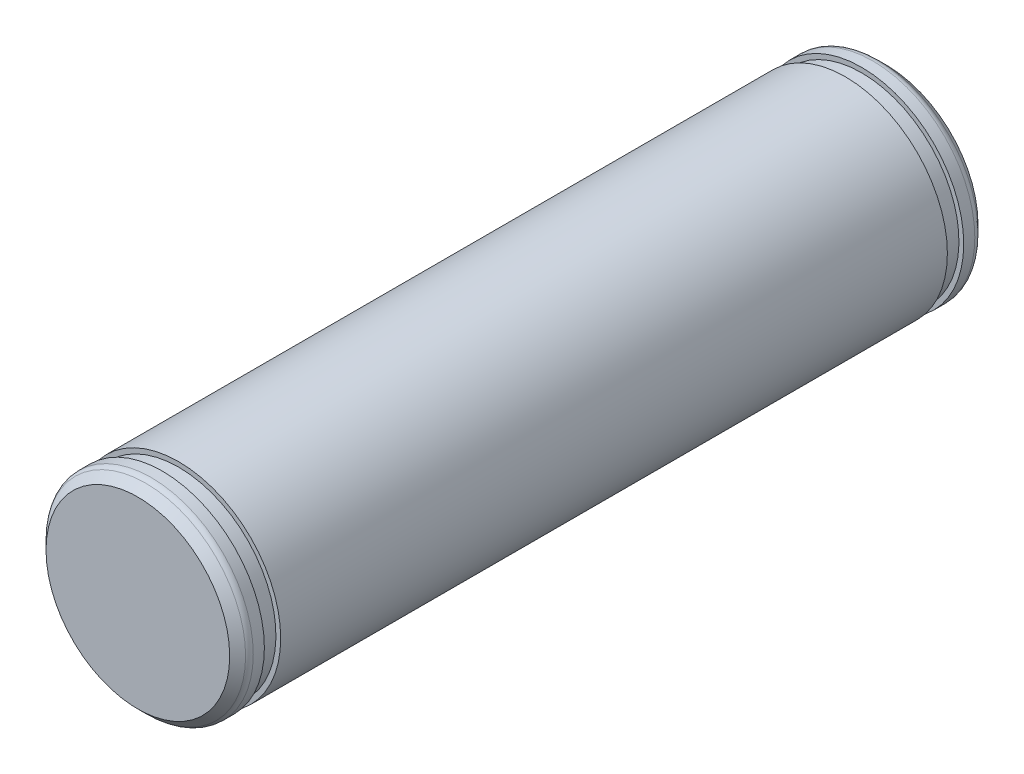
ISO-10303-21;
HEADER;
FILE_DESCRIPTION(('STEP AP214'),'2;1');
FILE_NAME('part.step','',(''),(''),'','','');
FILE_SCHEMA(('AUTOMOTIVE_DESIGN { 1 0 10303 214 1 1 1 1 }'));
ENDSEC;
DATA;
#1=APPLICATION_CONTEXT('core data for automotive mechanical design processes');
#2=APPLICATION_PROTOCOL_DEFINITION('international standard','automotive_design',2000,#1);
#3=PRODUCT_CONTEXT('',#1,'mechanical');
#4=PRODUCT('Part','Part','',(#3));
#5=PRODUCT_RELATED_PRODUCT_CATEGORY('part','',(#4));
#6=PRODUCT_DEFINITION_FORMATION('','',#4);
#7=PRODUCT_DEFINITION_CONTEXT('part definition',#1,'design');
#8=PRODUCT_DEFINITION('design','',#6,#7);
#9=PRODUCT_DEFINITION_SHAPE('','',#8);
#10=(LENGTH_UNIT() NAMED_UNIT(*) SI_UNIT(.MILLI.,.METRE.));
#11=(NAMED_UNIT(*) PLANE_ANGLE_UNIT() SI_UNIT($,.RADIAN.));
#12=(NAMED_UNIT(*) SI_UNIT($,.STERADIAN.) SOLID_ANGLE_UNIT());
#13=UNCERTAINTY_MEASURE_WITH_UNIT(LENGTH_MEASURE(1.E-05),#10,'distance_accuracy_value','');
#14=(GEOMETRIC_REPRESENTATION_CONTEXT(3) GLOBAL_UNCERTAINTY_ASSIGNED_CONTEXT((#13)) GLOBAL_UNIT_ASSIGNED_CONTEXT((#10,
#11,#12)) REPRESENTATION_CONTEXT('',''));
#15=CARTESIAN_POINT('',(0.,0.,0.));
#16=DIRECTION('',(0.,0.,1.));
#17=DIRECTION('',(1.,0.,0.));
#18=AXIS2_PLACEMENT_3D('',#15,#16,#17);
#19=CARTESIAN_POINT('',(0.,0.,27.5));
#20=DIRECTION('',(0.,0.,-1.));
#21=DIRECTION('',(-1.,0.,0.));
#22=AXIS2_PLACEMENT_3D('',#19,#20,#21);
#23=CYLINDRICAL_SURFACE('',#22,7.5);
#24=CARTESIAN_POINT('',(0.,0.,24.5));
#25=DIRECTION('',(0.,0.,-1.));
#26=DIRECTION('',(0.,1.,0.));
#27=AXIS2_PLACEMENT_3D('',#24,#25,#26);
#28=CIRCLE('',#27,7.49999999999999);
#29=CARTESIAN_POINT('',(0.,7.5,24.5));
#30=VERTEX_POINT('',#29);
#31=EDGE_CURVE('E107',#30,#30,#28,.T.);
#32=ORIENTED_EDGE('',*,*,#31,.T.);
#33=EDGE_LOOP('',(#32));
#34=FACE_BOUND('',#33,.T.);
#35=CARTESIAN_POINT('',(0.,0.,-24.5));
#36=DIRECTION('',(0.,0.,-1.));
#37=DIRECTION('',(0.,1.,0.));
#38=AXIS2_PLACEMENT_3D('',#35,#36,#37);
#39=CIRCLE('',#38,7.49999999999999);
#40=CARTESIAN_POINT('',(0.,7.5,-24.5));
#41=VERTEX_POINT('',#40);
#42=EDGE_CURVE('E91',#41,#41,#39,.T.);
#43=ORIENTED_EDGE('',*,*,#42,.F.);
#44=EDGE_LOOP('',(#43));
#45=FACE_BOUND('',#44,.T.);
#46=ADVANCED_FACE('F53',(#34,#45),#23,.T.);
#47=CARTESIAN_POINT('',(0.,0.,-27.5));
#48=DIRECTION('',(0.,0.,-1.));
#49=DIRECTION('',(0.,1.,0.));
#50=AXIS2_PLACEMENT_3D('',#47,#48,#49);
#51=CYLINDRICAL_SURFACE('',#50,7.14999999999999);
#52=CARTESIAN_POINT('',(0.,0.,-25.7));
#53=DIRECTION('',(0.,0.,-1.));
#54=DIRECTION('',(0.,1.,0.));
#55=AXIS2_PLACEMENT_3D('',#52,#53,#54);
#56=CIRCLE('',#55,7.14999999999999);
#57=CARTESIAN_POINT('',(0.,7.15,-25.7));
#58=VERTEX_POINT('',#57);
#59=EDGE_CURVE('E99',#58,#58,#56,.T.);
#60=ORIENTED_EDGE('',*,*,#59,.F.);
#61=EDGE_LOOP('',(#60));
#62=FACE_BOUND('',#61,.T.);
#63=CARTESIAN_POINT('',(0.,0.,-24.5));
#64=DIRECTION('',(0.,0.,-1.));
#65=DIRECTION('',(0.,1.,0.));
#66=AXIS2_PLACEMENT_3D('',#63,#64,#65);
#67=CIRCLE('',#66,7.14999999999999);
#68=CARTESIAN_POINT('',(0.,7.15,-24.5));
#69=VERTEX_POINT('',#68);
#70=EDGE_CURVE('E87',#69,#69,#67,.T.);
#71=ORIENTED_EDGE('',*,*,#70,.T.);
#72=EDGE_LOOP('',(#71));
#73=FACE_BOUND('',#72,.T.);
#74=ADVANCED_FACE('F141',(#62,#73),#51,.T.);
#75=CARTESIAN_POINT('',(0.,7.15,-24.5));
#76=DIRECTION('',(0.,0.,1.));
#77=DIRECTION('',(0.,-1.,0.));
#78=AXIS2_PLACEMENT_3D('',#75,#76,#77);
#79=PLANE('',#78);
#80=ORIENTED_EDGE('',*,*,#70,.F.);
#81=EDGE_LOOP('',(#80));
#82=FACE_BOUND('',#81,.T.);
#83=ORIENTED_EDGE('',*,*,#42,.T.);
#84=EDGE_LOOP('',(#83));
#85=FACE_BOUND('',#84,.T.);
#86=ADVANCED_FACE('F151',(#82,#85),#79,.F.);
#87=CARTESIAN_POINT('',(0.,7.5,-25.7));
#88=DIRECTION('',(0.,0.,-1.));
#89=DIRECTION('',(0.,1.,0.));
#90=AXIS2_PLACEMENT_3D('',#87,#88,#89);
#91=PLANE('',#90);
#92=CARTESIAN_POINT('',(0.,0.,-25.7));
#93=DIRECTION('',(0.,0.,-1.));
#94=DIRECTION('',(0.,1.,0.));
#95=AXIS2_PLACEMENT_3D('',#92,#93,#94);
#96=CIRCLE('',#95,7.49999999999999);
#97=CARTESIAN_POINT('',(0.,7.5,-25.7));
#98=VERTEX_POINT('',#97);
#99=EDGE_CURVE('E95',#98,#98,#96,.T.);
#100=ORIENTED_EDGE('',*,*,#99,.F.);
#101=EDGE_LOOP('',(#100));
#102=FACE_BOUND('',#101,.T.);
#103=ORIENTED_EDGE('',*,*,#59,.T.);
#104=EDGE_LOOP('',(#103));
#105=FACE_BOUND('',#104,.T.);
#106=ADVANCED_FACE('F172',(#102,#105),#91,.F.);
#107=CARTESIAN_POINT('',(0.,0.,-27.5));
#108=DIRECTION('',(0.,0.,1.));
#109=DIRECTION('',(1.,0.,0.));
#110=AXIS2_PLACEMENT_3D('',#107,#108,#109);
#111=PLANE('',#110);
#112=CARTESIAN_POINT('',(0.,0.,-27.5));
#113=DIRECTION('',(0.,0.,1.));
#114=DIRECTION('',(1.,0.,0.));
#115=AXIS2_PLACEMENT_3D('',#112,#113,#114);
#116=CIRCLE('',#115,6.74999999999999);
#117=CARTESIAN_POINT('',(6.74999999999999,0.,-27.5));
#118=VERTEX_POINT('',#117);
#119=EDGE_CURVE('E79',#118,#118,#116,.F.);
#120=ORIENTED_EDGE('',*,*,#119,.T.);
#121=EDGE_LOOP('',(#120));
#122=FACE_BOUND('',#121,.T.);
#123=ADVANCED_FACE('F174',(#122),#111,.F.);
#124=CARTESIAN_POINT('',(0.,0.,-26.75));
#125=DIRECTION('',(0.,0.,1.));
#126=DIRECTION('',(1.,0.,0.));
#127=AXIS2_PLACEMENT_3D('',#124,#125,#126);
#128=CONICAL_SURFACE('',#127,7.5,0.785398163397453);
#129=CARTESIAN_POINT('',(0.,0.,-26.9147524355826));
#130=DIRECTION('',(0.,0.,1.));
#131=DIRECTION('',(1.,0.,0.));
#132=AXIS2_PLACEMENT_3D('',#129,#130,#131);
#133=CIRCLE('',#132,7.33524756441743);
#134=CARTESIAN_POINT('',(7.33524756441743,0.,-26.9147524355826));
#135=VERTEX_POINT('',#134);
#136=EDGE_CURVE('E12',#135,#135,#133,.F.);
#137=ORIENTED_EDGE('',*,*,#136,.T.);
#138=EDGE_LOOP('',(#137));
#139=FACE_BOUND('',#138,.T.);
#140=ORIENTED_EDGE('',*,*,#119,.F.);
#141=EDGE_LOOP('',(#140));
#142=FACE_BOUND('',#141,.T.);
#143=ADVANCED_FACE('F165',(#139,#142),#128,.T.);
#144=CARTESIAN_POINT('',(0.,0.,-26.5170048711651));
#145=DIRECTION('',(0.,0.,-1.));
#146=DIRECTION('',(-1.,0.,0.));
#147=AXIS2_PLACEMENT_3D('',#144,#145,#146);
#148=TOROIDAL_SURFACE('',#147,6.9375,0.5625);
#149=ORIENTED_EDGE('',*,*,#136,.F.);
#150=EDGE_LOOP('',(#149));
#151=FACE_BOUND('',#150,.T.);
#152=CARTESIAN_POINT('',(0.,0.,-26.5170048711651));
#153=DIRECTION('',(0.,0.,-1.));
#154=DIRECTION('',(-1.,0.,0.));
#155=AXIS2_PLACEMENT_3D('',#152,#153,#154);
#156=CIRCLE('',#155,7.5);
#157=CARTESIAN_POINT('',(-7.5,0.,-26.5170048711651));
#158=VERTEX_POINT('',#157);
#159=EDGE_CURVE('E73',#158,#158,#156,.F.);
#160=ORIENTED_EDGE('',*,*,#159,.F.);
#161=EDGE_LOOP('',(#160));
#162=FACE_BOUND('',#161,.T.);
#163=ADVANCED_FACE('F55',(#151,#162),#148,.T.);
#164=ORIENTED_EDGE('',*,*,#99,.T.);
#165=EDGE_LOOP('',(#164));
#166=FACE_BOUND('',#165,.T.);
#167=ORIENTED_EDGE('',*,*,#159,.T.);
#168=EDGE_LOOP('',(#167));
#169=FACE_BOUND('',#168,.T.);
#170=ADVANCED_FACE('F145',(#166,#169),#23,.T.);
#171=CARTESIAN_POINT('',(0.,0.,27.5));
#172=DIRECTION('',(0.,0.,1.));
#173=DIRECTION('',(0.,1.,0.));
#174=AXIS2_PLACEMENT_3D('',#171,#172,#173);
#175=CYLINDRICAL_SURFACE('',#174,7.14999999999999);
#176=CARTESIAN_POINT('',(0.,0.,25.7));
#177=DIRECTION('',(0.,0.,-1.));
#178=DIRECTION('',(0.,1.,0.));
#179=AXIS2_PLACEMENT_3D('',#176,#177,#178);
#180=CIRCLE('',#179,7.14999999999999);
#181=CARTESIAN_POINT('',(0.,7.15,25.7));
#182=VERTEX_POINT('',#181);
#183=EDGE_CURVE('E115',#182,#182,#180,.T.);
#184=ORIENTED_EDGE('',*,*,#183,.T.);
#185=EDGE_LOOP('',(#184));
#186=FACE_BOUND('',#185,.T.);
#187=CARTESIAN_POINT('',(0.,0.,24.5));
#188=DIRECTION('',(0.,0.,-1.));
#189=DIRECTION('',(0.,1.,0.));
#190=AXIS2_PLACEMENT_3D('',#187,#188,#189);
#191=CIRCLE('',#190,7.14999999999999);
#192=CARTESIAN_POINT('',(0.,7.15,24.5));
#193=VERTEX_POINT('',#192);
#194=EDGE_CURVE('E103',#193,#193,#191,.T.);
#195=ORIENTED_EDGE('',*,*,#194,.F.);
#196=EDGE_LOOP('',(#195));
#197=FACE_BOUND('',#196,.T.);
#198=ADVANCED_FACE('F121',(#186,#197),#175,.T.);
#199=CARTESIAN_POINT('',(0.,7.15,24.5));
#200=DIRECTION('',(0.,0.,-1.));
#201=DIRECTION('',(0.,-1.,0.));
#202=AXIS2_PLACEMENT_3D('',#199,#200,#201);
#203=PLANE('',#202);
#204=ORIENTED_EDGE('',*,*,#194,.T.);
#205=EDGE_LOOP('',(#204));
#206=FACE_BOUND('',#205,.T.);
#207=ORIENTED_EDGE('',*,*,#31,.F.);
#208=EDGE_LOOP('',(#207));
#209=FACE_BOUND('',#208,.T.);
#210=ADVANCED_FACE('F127',(#206,#209),#203,.F.);
#211=CARTESIAN_POINT('',(0.,7.5,25.7));
#212=DIRECTION('',(0.,0.,1.));
#213=DIRECTION('',(0.,1.,0.));
#214=AXIS2_PLACEMENT_3D('',#211,#212,#213);
#215=PLANE('',#214);
#216=CARTESIAN_POINT('',(0.,0.,25.7));
#217=DIRECTION('',(0.,0.,-1.));
#218=DIRECTION('',(0.,1.,0.));
#219=AXIS2_PLACEMENT_3D('',#216,#217,#218);
#220=CIRCLE('',#219,7.49999999999999);
#221=CARTESIAN_POINT('',(0.,7.5,25.7));
#222=VERTEX_POINT('',#221);
#223=EDGE_CURVE('E111',#222,#222,#220,.T.);
#224=ORIENTED_EDGE('',*,*,#223,.T.);
#225=EDGE_LOOP('',(#224));
#226=FACE_BOUND('',#225,.T.);
#227=ORIENTED_EDGE('',*,*,#183,.F.);
#228=EDGE_LOOP('',(#227));
#229=FACE_BOUND('',#228,.T.);
#230=ADVANCED_FACE('F124',(#226,#229),#215,.F.);
#231=CARTESIAN_POINT('',(0.,0.,27.5));
#232=DIRECTION('',(0.,0.,1.));
#233=DIRECTION('',(1.,0.,0.));
#234=AXIS2_PLACEMENT_3D('',#231,#232,#233);
#235=PLANE('',#234);
#236=CARTESIAN_POINT('',(0.,0.,27.5));
#237=DIRECTION('',(0.,0.,1.));
#238=DIRECTION('',(1.,0.,0.));
#239=AXIS2_PLACEMENT_3D('',#236,#237,#238);
#240=CIRCLE('',#239,6.75000000000001);
#241=CARTESIAN_POINT('',(6.75000000000001,0.,27.5));
#242=VERTEX_POINT('',#241);
#243=EDGE_CURVE('E83',#242,#242,#240,.T.);
#244=ORIENTED_EDGE('',*,*,#243,.T.);
#245=EDGE_LOOP('',(#244));
#246=FACE_BOUND('',#245,.T.);
#247=ADVANCED_FACE('F126',(#246),#235,.T.);
#248=CARTESIAN_POINT('',(0.,0.,27.5));
#249=DIRECTION('',(0.,0.,-1.));
#250=DIRECTION('',(-1.,0.,0.));
#251=AXIS2_PLACEMENT_3D('',#248,#249,#250);
#252=CONICAL_SURFACE('',#251,6.75000000000001,0.785398163397447);
#253=CARTESIAN_POINT('',(0.,0.,26.9147524355826));
#254=DIRECTION('',(0.,0.,-1.));
#255=DIRECTION('',(-1.,0.,0.));
#256=AXIS2_PLACEMENT_3D('',#253,#254,#255);
#257=CIRCLE('',#256,7.33524756441744);
#258=CARTESIAN_POINT('',(-7.33524756441744,0.,26.9147524355826));
#259=VERTEX_POINT('',#258);
#260=EDGE_CURVE('E61',#259,#259,#257,.F.);
#261=ORIENTED_EDGE('',*,*,#260,.T.);
#262=EDGE_LOOP('',(#261));
#263=FACE_BOUND('',#262,.T.);
#264=ORIENTED_EDGE('',*,*,#243,.F.);
#265=EDGE_LOOP('',(#264));
#266=FACE_BOUND('',#265,.T.);
#267=ADVANCED_FACE('F135',(#263,#266),#252,.T.);
#268=CARTESIAN_POINT('',(0.,0.,26.5170048711651));
#269=DIRECTION('',(0.,0.,1.));
#270=DIRECTION('',(1.,0.,0.));
#271=AXIS2_PLACEMENT_3D('',#268,#269,#270);
#272=TOROIDAL_SURFACE('',#271,6.9375,0.5625);
#273=ORIENTED_EDGE('',*,*,#260,.F.);
#274=EDGE_LOOP('',(#273));
#275=FACE_BOUND('',#274,.T.);
#276=CARTESIAN_POINT('',(0.,0.,26.5170048711651));
#277=DIRECTION('',(0.,0.,1.));
#278=DIRECTION('',(1.,0.,0.));
#279=AXIS2_PLACEMENT_3D('',#276,#277,#278);
#280=CIRCLE('',#279,7.5);
#281=CARTESIAN_POINT('',(7.5,0.,26.5170048711651));
#282=VERTEX_POINT('',#281);
#283=EDGE_CURVE('E67',#282,#282,#280,.F.);
#284=ORIENTED_EDGE('',*,*,#283,.F.);
#285=EDGE_LOOP('',(#284));
#286=FACE_BOUND('',#285,.T.);
#287=ADVANCED_FACE('F157',(#275,#286),#272,.T.);
#288=ORIENTED_EDGE('',*,*,#223,.F.);
#289=EDGE_LOOP('',(#288));
#290=FACE_BOUND('',#289,.T.);
#291=ORIENTED_EDGE('',*,*,#283,.T.);
#292=EDGE_LOOP('',(#291));
#293=FACE_BOUND('',#292,.T.);
#294=ADVANCED_FACE('F144',(#290,#293),#23,.T.);
#295=CLOSED_SHELL('',(#46,#74,#86,#106,#123,#143,#163,#170,#198,#210,#230,#247,#267,#287,#294));
#296=MANIFOLD_SOLID_BREP('B2',#295);
#297=ADVANCED_BREP_SHAPE_REPRESENTATION('',(#18,#296),#14);
#298=SHAPE_DEFINITION_REPRESENTATION(#9,#297);
ENDSEC;
END-ISO-10303-21;
